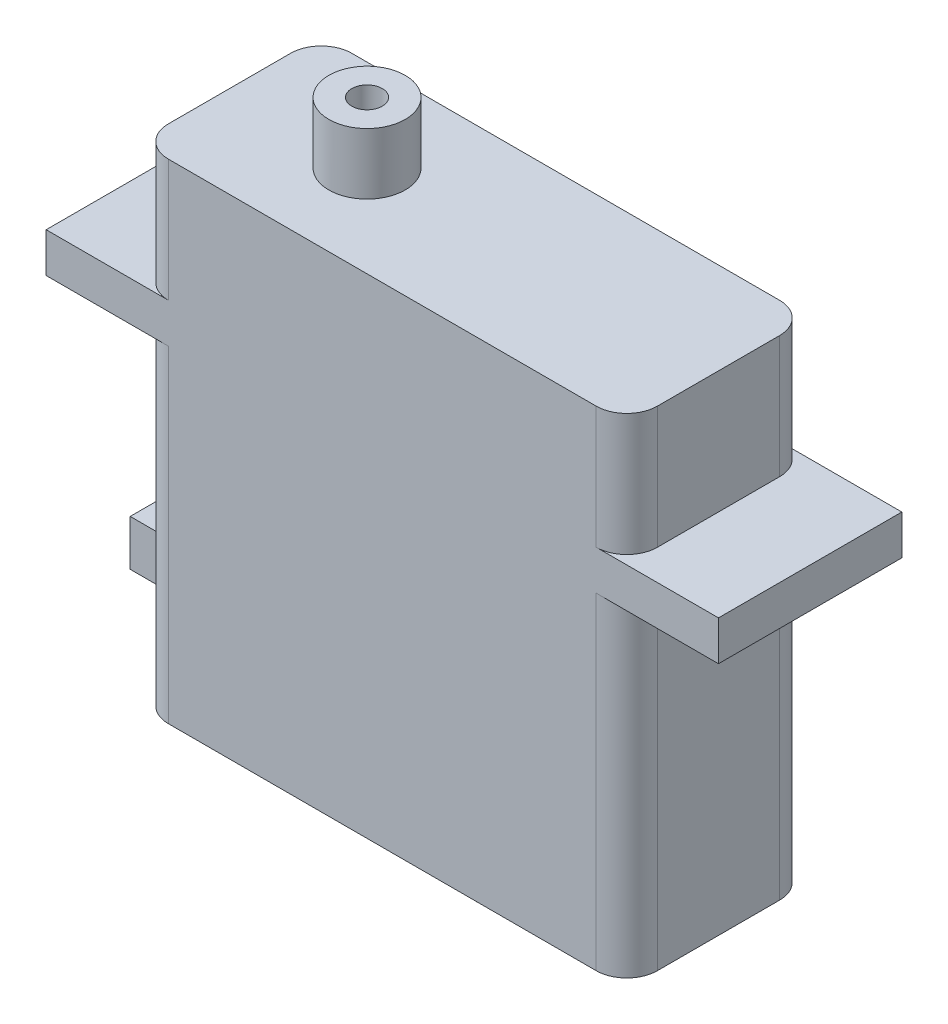
ISO-10303-21;
HEADER;
FILE_DESCRIPTION(('STEP AP214'),'2;1');
FILE_NAME('part.step','',(''),(''),'','','');
FILE_SCHEMA(('AUTOMOTIVE_DESIGN { 1 0 10303 214 1 1 1 1 }'));
ENDSEC;
DATA;
#1=APPLICATION_CONTEXT('core data for automotive mechanical design processes');
#2=APPLICATION_PROTOCOL_DEFINITION('international standard','automotive_design',2000,#1);
#3=PRODUCT_CONTEXT('',#1,'mechanical');
#4=PRODUCT('Part','Part','',(#3));
#5=PRODUCT_RELATED_PRODUCT_CATEGORY('part','',(#4));
#6=PRODUCT_DEFINITION_FORMATION('','',#4);
#7=PRODUCT_DEFINITION_CONTEXT('part definition',#1,'design');
#8=PRODUCT_DEFINITION('design','',#6,#7);
#9=PRODUCT_DEFINITION_SHAPE('','',#8);
#10=(LENGTH_UNIT() NAMED_UNIT(*) SI_UNIT(.MILLI.,.METRE.));
#11=(NAMED_UNIT(*) PLANE_ANGLE_UNIT() SI_UNIT($,.RADIAN.));
#12=(NAMED_UNIT(*) SI_UNIT($,.STERADIAN.) SOLID_ANGLE_UNIT());
#13=UNCERTAINTY_MEASURE_WITH_UNIT(LENGTH_MEASURE(1.E-05),#10,'distance_accuracy_value','');
#14=(GEOMETRIC_REPRESENTATION_CONTEXT(3) GLOBAL_UNCERTAINTY_ASSIGNED_CONTEXT((#13)) GLOBAL_UNIT_ASSIGNED_CONTEXT((#10,
#11,#12)) REPRESENTATION_CONTEXT('',''));
#15=CARTESIAN_POINT('',(0.,0.,0.));
#16=DIRECTION('',(0.,0.,1.));
#17=DIRECTION('',(1.,0.,0.));
#18=AXIS2_PLACEMENT_3D('',#15,#16,#17);
#19=CARTESIAN_POINT('',(41.5914381270903,0.,15.24));
#20=DIRECTION('',(-1.,0.,0.));
#21=DIRECTION('',(0.,0.,1.));
#22=AXIS2_PLACEMENT_3D('',#19,#20,#21);
#23=PLANE('',#22);
#24=DIRECTION('',(0.,1.,0.));
#25=VECTOR('',#24,1.);
#26=CARTESIAN_POINT('',(41.5914381270903,0.,12.7));
#27=LINE('',#26,#25);
#28=CARTESIAN_POINT('',(41.5914381270903,40.64,12.7));
#29=VERTEX_POINT('',#28);
#30=CARTESIAN_POINT('',(41.5914381270903,30.48,12.7));
#31=VERTEX_POINT('',#30);
#32=EDGE_CURVE('E369',#29,#31,#27,.F.);
#33=ORIENTED_EDGE('',*,*,#32,.T.);
#34=DIRECTION('',(0.,0.,-1.));
#35=VECTOR('',#34,1.);
#36=CARTESIAN_POINT('',(41.5914381270903,30.48,15.24));
#37=LINE('',#36,#35);
#38=CARTESIAN_POINT('',(41.5914381270903,30.48,2.54));
#39=VERTEX_POINT('',#38);
#40=EDGE_CURVE('E229',#31,#39,#37,.T.);
#41=ORIENTED_EDGE('',*,*,#40,.T.);
#42=DIRECTION('',(0.,1.,0.));
#43=VECTOR('',#42,1.);
#44=CARTESIAN_POINT('',(41.5914381270903,40.64,2.54));
#45=LINE('',#44,#43);
#46=CARTESIAN_POINT('',(41.5914381270903,40.64,2.54));
#47=VERTEX_POINT('',#46);
#48=EDGE_CURVE('E372',#39,#47,#45,.T.);
#49=ORIENTED_EDGE('',*,*,#48,.T.);
#50=DIRECTION('',(0.,0.,-1.));
#51=VECTOR('',#50,1.);
#52=CARTESIAN_POINT('',(41.5914381270903,40.64,15.24));
#53=LINE('',#52,#51);
#54=EDGE_CURVE('E318',#29,#47,#53,.T.);
#55=ORIENTED_EDGE('',*,*,#54,.F.);
#56=EDGE_LOOP('',(#33,#41,#49,#55));
#57=FACE_BOUND('',#56,.T.);
#58=ADVANCED_FACE('F33',(#57),#23,.F.);
#59=CARTESIAN_POINT('',(39.0514381270903,0.,2.54));
#60=DIRECTION('',(0.,-1.,0.));
#61=DIRECTION('',(0.,0.,-1.));
#62=AXIS2_PLACEMENT_3D('',#59,#60,#61);
#63=CYLINDRICAL_SURFACE('',#62,2.54);
#64=CARTESIAN_POINT('',(39.0514381270903,30.48,2.54));
#65=DIRECTION('',(0.,1.,0.));
#66=DIRECTION('',(0.,0.,1.));
#67=AXIS2_PLACEMENT_3D('',#64,#65,#66);
#68=CIRCLE('',#67,2.54);
#69=CARTESIAN_POINT('',(39.0514381270903,30.48,0.));
#70=VERTEX_POINT('',#69);
#71=EDGE_CURVE('E232',#70,#39,#68,.F.);
#72=ORIENTED_EDGE('',*,*,#71,.F.);
#73=DIRECTION('',(0.,1.,0.));
#74=VECTOR('',#73,1.);
#75=CARTESIAN_POINT('',(39.0514381270903,0.,0.));
#76=LINE('',#75,#74);
#77=CARTESIAN_POINT('',(39.0514381270903,40.64,0.));
#78=VERTEX_POINT('',#77);
#79=EDGE_CURVE('E347',#78,#70,#76,.F.);
#80=ORIENTED_EDGE('',*,*,#79,.F.);
#81=CARTESIAN_POINT('',(39.0514381270903,40.64,2.54));
#82=DIRECTION('',(0.,-1.,0.));
#83=DIRECTION('',(0.,0.,-1.));
#84=AXIS2_PLACEMENT_3D('',#81,#82,#83);
#85=CIRCLE('',#84,2.54);
#86=EDGE_CURVE('E356',#47,#78,#85,.F.);
#87=ORIENTED_EDGE('',*,*,#86,.F.);
#88=ORIENTED_EDGE('',*,*,#48,.F.);
#89=EDGE_LOOP('',(#72,#80,#87,#88));
#90=FACE_BOUND('',#89,.T.);
#91=ADVANCED_FACE('F414',(#90),#63,.T.);
#92=CARTESIAN_POINT('',(39.0514381270903,0.,12.7));
#93=DIRECTION('',(0.,1.,0.));
#94=DIRECTION('',(0.,0.,1.));
#95=AXIS2_PLACEMENT_3D('',#92,#93,#94);
#96=CYLINDRICAL_SURFACE('',#95,2.54);
#97=CARTESIAN_POINT('',(39.0514381270903,30.48,12.7));
#98=DIRECTION('',(0.,1.,0.));
#99=DIRECTION('',(0.,0.,1.));
#100=AXIS2_PLACEMENT_3D('',#97,#98,#99);
#101=CIRCLE('',#100,2.54);
#102=CARTESIAN_POINT('',(39.0514381270903,30.48,15.24));
#103=VERTEX_POINT('',#102);
#104=EDGE_CURVE('E11',#31,#103,#101,.F.);
#105=ORIENTED_EDGE('',*,*,#104,.F.);
#106=ORIENTED_EDGE('',*,*,#32,.F.);
#107=CARTESIAN_POINT('',(39.0514381270903,40.64,12.7));
#108=DIRECTION('',(0.,-1.,0.));
#109=DIRECTION('',(0.,0.,-1.));
#110=AXIS2_PLACEMENT_3D('',#107,#108,#109);
#111=CIRCLE('',#110,2.54);
#112=CARTESIAN_POINT('',(39.0514381270903,40.64,15.24));
#113=VERTEX_POINT('',#112);
#114=EDGE_CURVE('E354',#113,#29,#111,.F.);
#115=ORIENTED_EDGE('',*,*,#114,.F.);
#116=DIRECTION('',(0.,1.,0.));
#117=VECTOR('',#116,1.);
#118=CARTESIAN_POINT('',(39.0514381270903,0.,15.24));
#119=LINE('',#118,#117);
#120=EDGE_CURVE('E362',#103,#113,#119,.T.);
#121=ORIENTED_EDGE('',*,*,#120,.F.);
#122=EDGE_LOOP('',(#105,#106,#115,#121));
#123=FACE_BOUND('',#122,.T.);
#124=ADVANCED_FACE('F420',(#123),#96,.T.);
#125=CARTESIAN_POINT('',(0.951438127090312,0.,15.24));
#126=DIRECTION('',(1.,0.,0.));
#127=DIRECTION('',(0.,1.,0.));
#128=AXIS2_PLACEMENT_3D('',#125,#126,#127);
#129=PLANE('',#128);
#130=DIRECTION('',(0.,-1.,0.));
#131=VECTOR('',#130,1.);
#132=CARTESIAN_POINT('',(0.951438127090313,0.,2.54));
#133=LINE('',#132,#131);
#134=CARTESIAN_POINT('',(0.951438127090309,40.64,2.54));
#135=VERTEX_POINT('',#134);
#136=CARTESIAN_POINT('',(0.95143812709031,30.48,2.54));
#137=VERTEX_POINT('',#136);
#138=EDGE_CURVE('E335',#135,#137,#133,.T.);
#139=ORIENTED_EDGE('',*,*,#138,.T.);
#140=DIRECTION('',(0.,0.,1.));
#141=VECTOR('',#140,1.);
#142=CARTESIAN_POINT('',(0.95143812709031,30.48,15.24));
#143=LINE('',#142,#141);
#144=CARTESIAN_POINT('',(0.95143812709031,30.48,12.7));
#145=VERTEX_POINT('',#144);
#146=EDGE_CURVE('E258',#137,#145,#143,.T.);
#147=ORIENTED_EDGE('',*,*,#146,.T.);
#148=DIRECTION('',(0.,-1.,0.));
#149=VECTOR('',#148,1.);
#150=CARTESIAN_POINT('',(0.951438127090312,0.,12.7));
#151=LINE('',#150,#149);
#152=CARTESIAN_POINT('',(0.951438127090309,40.64,12.7));
#153=VERTEX_POINT('',#152);
#154=EDGE_CURVE('E330',#145,#153,#151,.F.);
#155=ORIENTED_EDGE('',*,*,#154,.T.);
#156=DIRECTION('',(0.,0.,-1.));
#157=VECTOR('',#156,1.);
#158=CARTESIAN_POINT('',(0.951438127090309,40.64,15.24));
#159=LINE('',#158,#157);
#160=EDGE_CURVE('E311',#153,#135,#159,.T.);
#161=ORIENTED_EDGE('',*,*,#160,.T.);
#162=EDGE_LOOP('',(#139,#147,#155,#161));
#163=FACE_BOUND('',#162,.T.);
#164=ADVANCED_FACE('F443',(#163),#129,.F.);
#165=CARTESIAN_POINT('',(3.49143812709031,0.,2.54));
#166=DIRECTION('',(0.,1.,0.));
#167=DIRECTION('',(-1.,0.,0.));
#168=AXIS2_PLACEMENT_3D('',#165,#166,#167);
#169=CYLINDRICAL_SURFACE('',#168,2.54);
#170=CARTESIAN_POINT('',(3.49143812709031,30.48,2.54));
#171=DIRECTION('',(0.,1.,0.));
#172=DIRECTION('',(-1.,0.,0.));
#173=AXIS2_PLACEMENT_3D('',#170,#171,#172);
#174=CIRCLE('',#173,2.54);
#175=CARTESIAN_POINT('',(3.49143812709031,30.48,0.));
#176=VERTEX_POINT('',#175);
#177=EDGE_CURVE('E261',#137,#176,#174,.F.);
#178=ORIENTED_EDGE('',*,*,#177,.F.);
#179=ORIENTED_EDGE('',*,*,#138,.F.);
#180=CARTESIAN_POINT('',(3.49143812709031,40.64,2.54));
#181=DIRECTION('',(0.,-1.,0.));
#182=DIRECTION('',(0.,0.,-1.));
#183=AXIS2_PLACEMENT_3D('',#180,#181,#182);
#184=CIRCLE('',#183,2.54);
#185=CARTESIAN_POINT('',(3.49143812709031,40.64,0.));
#186=VERTEX_POINT('',#185);
#187=EDGE_CURVE('E360',#186,#135,#184,.F.);
#188=ORIENTED_EDGE('',*,*,#187,.F.);
#189=DIRECTION('',(0.,-1.,0.));
#190=VECTOR('',#189,1.);
#191=CARTESIAN_POINT('',(3.49143812709031,40.64,0.));
#192=LINE('',#191,#190);
#193=EDGE_CURVE('E350',#176,#186,#192,.F.);
#194=ORIENTED_EDGE('',*,*,#193,.F.);
#195=EDGE_LOOP('',(#178,#179,#188,#194));
#196=FACE_BOUND('',#195,.T.);
#197=ADVANCED_FACE('F447',(#196),#169,.T.);
#198=CARTESIAN_POINT('',(3.49143812709031,0.,12.7));
#199=DIRECTION('',(0.,-1.,0.));
#200=DIRECTION('',(1.,0.,0.));
#201=AXIS2_PLACEMENT_3D('',#198,#199,#200);
#202=CYLINDRICAL_SURFACE('',#201,2.54);
#203=CARTESIAN_POINT('',(3.49143812709031,30.48,12.7));
#204=DIRECTION('',(0.,1.,0.));
#205=DIRECTION('',(-1.,0.,0.));
#206=AXIS2_PLACEMENT_3D('',#203,#204,#205);
#207=CIRCLE('',#206,2.54);
#208=CARTESIAN_POINT('',(3.49143812709031,30.48,15.24));
#209=VERTEX_POINT('',#208);
#210=EDGE_CURVE('E378',#209,#145,#207,.F.);
#211=ORIENTED_EDGE('',*,*,#210,.F.);
#212=DIRECTION('',(0.,-1.,0.));
#213=VECTOR('',#212,1.);
#214=CARTESIAN_POINT('',(3.49143812709031,0.,15.24));
#215=LINE('',#214,#213);
#216=CARTESIAN_POINT('',(3.49143812709031,40.64,15.24));
#217=VERTEX_POINT('',#216);
#218=EDGE_CURVE('E365',#217,#209,#215,.T.);
#219=ORIENTED_EDGE('',*,*,#218,.F.);
#220=CARTESIAN_POINT('',(3.49143812709031,40.64,12.7));
#221=DIRECTION('',(0.,-1.,0.));
#222=DIRECTION('',(0.,0.,-1.));
#223=AXIS2_PLACEMENT_3D('',#220,#221,#222);
#224=CIRCLE('',#223,2.54);
#225=EDGE_CURVE('E358',#153,#217,#224,.F.);
#226=ORIENTED_EDGE('',*,*,#225,.F.);
#227=ORIENTED_EDGE('',*,*,#154,.F.);
#228=EDGE_LOOP('',(#211,#219,#226,#227));
#229=FACE_BOUND('',#228,.T.);
#230=ADVANCED_FACE('F422',(#229),#202,.T.);
#231=CARTESIAN_POINT('',(0.951438127090312,0.,12.7));
#232=VERTEX_POINT('',#231);
#233=CARTESIAN_POINT('',(0.951438127090309,27.178,12.7));
#234=VERTEX_POINT('',#233);
#235=EDGE_CURVE('E331',#232,#234,#151,.F.);
#236=ORIENTED_EDGE('',*,*,#235,.T.);
#237=DIRECTION('',(0.,0.,-1.));
#238=VECTOR('',#237,1.);
#239=CARTESIAN_POINT('',(0.95143812709031,27.178,15.24));
#240=LINE('',#239,#238);
#241=CARTESIAN_POINT('',(0.95143812709031,27.178,2.54));
#242=VERTEX_POINT('',#241);
#243=EDGE_CURVE('E249',#234,#242,#240,.T.);
#244=ORIENTED_EDGE('',*,*,#243,.T.);
#245=CARTESIAN_POINT('',(0.951438127090312,0.,2.54));
#246=VERTEX_POINT('',#245);
#247=EDGE_CURVE('E334',#242,#246,#133,.T.);
#248=ORIENTED_EDGE('',*,*,#247,.T.);
#249=DIRECTION('',(0.,0.,-1.));
#250=VECTOR('',#249,1.);
#251=CARTESIAN_POINT('',(0.951438127090312,0.,15.24));
#252=LINE('',#251,#250);
#253=EDGE_CURVE('E324',#232,#246,#252,.T.);
#254=ORIENTED_EDGE('',*,*,#253,.F.);
#255=EDGE_LOOP('',(#236,#244,#248,#254));
#256=FACE_BOUND('',#255,.T.);
#257=DIRECTION('',(0.,-1.,0.));
#258=VECTOR('',#257,1.);
#259=CARTESIAN_POINT('',(0.951438127090312,5.08,4.445));
#260=LINE('',#259,#258);
#261=CARTESIAN_POINT('',(0.951438127090311,8.89,4.445));
#262=VERTEX_POINT('',#261);
#263=CARTESIAN_POINT('',(0.951438127090312,5.08,4.445));
#264=VERTEX_POINT('',#263);
#265=EDGE_CURVE('E263',#262,#264,#260,.T.);
#266=ORIENTED_EDGE('',*,*,#265,.F.);
#267=DIRECTION('',(0.,0.,-1.));
#268=VECTOR('',#267,1.);
#269=CARTESIAN_POINT('',(0.951438127090311,8.89,4.445));
#270=LINE('',#269,#268);
#271=CARTESIAN_POINT('',(0.951438127090311,8.89,10.795));
#272=VERTEX_POINT('',#271);
#273=EDGE_CURVE('E268',#272,#262,#270,.T.);
#274=ORIENTED_EDGE('',*,*,#273,.F.);
#275=DIRECTION('',(0.,1.,0.));
#276=VECTOR('',#275,1.);
#277=CARTESIAN_POINT('',(0.951438127090312,5.08,10.795));
#278=LINE('',#277,#276);
#279=CARTESIAN_POINT('',(0.951438127090312,5.08,10.795));
#280=VERTEX_POINT('',#279);
#281=EDGE_CURVE('E280',#280,#272,#278,.T.);
#282=ORIENTED_EDGE('',*,*,#281,.F.);
#283=DIRECTION('',(0.,0.,1.));
#284=VECTOR('',#283,1.);
#285=CARTESIAN_POINT('',(0.951438127090312,5.08,4.445));
#286=LINE('',#285,#284);
#287=EDGE_CURVE('E277',#264,#280,#286,.T.);
#288=ORIENTED_EDGE('',*,*,#287,.F.);
#289=EDGE_LOOP('',(#266,#274,#282,#288));
#290=FACE_BOUND('',#289,.T.);
#291=ADVANCED_FACE('F398',(#256,#290),#129,.F.);
#292=CARTESIAN_POINT('',(0.951438127090312,0.,15.24));
#293=DIRECTION('',(0.,1.,0.));
#294=DIRECTION('',(0.,0.,1.));
#295=AXIS2_PLACEMENT_3D('',#292,#293,#294);
#296=PLANE('',#295);
#297=ORIENTED_EDGE('',*,*,#253,.T.);
#298=CARTESIAN_POINT('',(3.49143812709031,0.,2.54));
#299=DIRECTION('',(0.,1.,0.));
#300=DIRECTION('',(0.,0.,1.));
#301=AXIS2_PLACEMENT_3D('',#298,#299,#300);
#302=CIRCLE('',#301,2.54);
#303=CARTESIAN_POINT('',(3.49143812709031,0.,0.));
#304=VERTEX_POINT('',#303);
#305=EDGE_CURVE('E344',#246,#304,#302,.F.);
#306=ORIENTED_EDGE('',*,*,#305,.T.);
#307=DIRECTION('',(1.,0.,0.));
#308=VECTOR('',#307,1.);
#309=CARTESIAN_POINT('',(0.951438127090312,0.,0.));
#310=LINE('',#309,#308);
#311=CARTESIAN_POINT('',(39.0514381270903,0.,0.));
#312=VERTEX_POINT('',#311);
#313=EDGE_CURVE('E305',#304,#312,#310,.T.);
#314=ORIENTED_EDGE('',*,*,#313,.T.);
#315=CARTESIAN_POINT('',(39.0514381270903,0.,2.54));
#316=DIRECTION('',(0.,1.,0.));
#317=DIRECTION('',(0.,0.,1.));
#318=AXIS2_PLACEMENT_3D('',#315,#316,#317);
#319=CIRCLE('',#318,2.54);
#320=CARTESIAN_POINT('',(41.5914381270903,0.,2.54));
#321=VERTEX_POINT('',#320);
#322=EDGE_CURVE('E340',#312,#321,#319,.F.);
#323=ORIENTED_EDGE('',*,*,#322,.T.);
#324=DIRECTION('',(0.,0.,-1.));
#325=VECTOR('',#324,1.);
#326=CARTESIAN_POINT('',(41.5914381270903,0.,15.24));
#327=LINE('',#326,#325);
#328=CARTESIAN_POINT('',(41.5914381270903,0.,12.7));
#329=VERTEX_POINT('',#328);
#330=EDGE_CURVE('E321',#329,#321,#327,.T.);
#331=ORIENTED_EDGE('',*,*,#330,.F.);
#332=CARTESIAN_POINT('',(39.0514381270903,0.,12.7));
#333=DIRECTION('',(0.,1.,0.));
#334=DIRECTION('',(0.,0.,1.));
#335=AXIS2_PLACEMENT_3D('',#332,#333,#334);
#336=CIRCLE('',#335,2.54);
#337=CARTESIAN_POINT('',(39.0514381270903,0.,15.24));
#338=VERTEX_POINT('',#337);
#339=EDGE_CURVE('E338',#329,#338,#336,.F.);
#340=ORIENTED_EDGE('',*,*,#339,.T.);
#341=DIRECTION('',(1.,0.,0.));
#342=VECTOR('',#341,1.);
#343=CARTESIAN_POINT('',(0.951438127090312,0.,15.24));
#344=LINE('',#343,#342);
#345=CARTESIAN_POINT('',(3.49143812709031,0.,15.24));
#346=VERTEX_POINT('',#345);
#347=EDGE_CURVE('E306',#346,#338,#344,.T.);
#348=ORIENTED_EDGE('',*,*,#347,.F.);
#349=CARTESIAN_POINT('',(3.49143812709031,0.,12.7));
#350=DIRECTION('',(0.,1.,0.));
#351=DIRECTION('',(0.,0.,1.));
#352=AXIS2_PLACEMENT_3D('',#349,#350,#351);
#353=CIRCLE('',#352,2.54);
#354=EDGE_CURVE('E342',#346,#232,#353,.F.);
#355=ORIENTED_EDGE('',*,*,#354,.T.);
#356=EDGE_LOOP('',(#297,#306,#314,#323,#331,#340,#348,#355));
#357=FACE_BOUND('',#356,.T.);
#358=ADVANCED_FACE('F389',(#357),#296,.F.);
#359=CARTESIAN_POINT('',(41.5914381270903,27.178,2.54));
#360=VERTEX_POINT('',#359);
#361=EDGE_CURVE('E373',#321,#360,#45,.T.);
#362=ORIENTED_EDGE('',*,*,#361,.T.);
#363=DIRECTION('',(0.,0.,1.));
#364=VECTOR('',#363,1.);
#365=CARTESIAN_POINT('',(41.5914381270903,27.178,15.24));
#366=LINE('',#365,#364);
#367=CARTESIAN_POINT('',(41.5914381270903,27.178,12.7));
#368=VERTEX_POINT('',#367);
#369=EDGE_CURVE('E221',#360,#368,#366,.T.);
#370=ORIENTED_EDGE('',*,*,#369,.T.);
#371=EDGE_CURVE('E368',#368,#329,#27,.F.);
#372=ORIENTED_EDGE('',*,*,#371,.T.);
#373=ORIENTED_EDGE('',*,*,#330,.T.);
#374=EDGE_LOOP('',(#362,#370,#372,#373));
#375=FACE_BOUND('',#374,.T.);
#376=ADVANCED_FACE('F383',(#375),#23,.F.);
#377=CARTESIAN_POINT('',(0.951438127090309,40.64,15.24));
#378=DIRECTION('',(0.,-1.,0.));
#379=DIRECTION('',(0.,0.,-1.));
#380=AXIS2_PLACEMENT_3D('',#377,#378,#379);
#381=PLANE('',#380);
#382=CARTESIAN_POINT('',(12.3814381270903,40.64,7.62));
#383=DIRECTION('',(0.,-1.,0.));
#384=DIRECTION('',(0.,0.,-1.));
#385=AXIS2_PLACEMENT_3D('',#382,#383,#384);
#386=CIRCLE('',#385,3.175);
#387=CARTESIAN_POINT('',(12.3814381270903,40.64,4.445));
#388=VERTEX_POINT('',#387);
#389=EDGE_CURVE('E327',#388,#388,#386,.F.);
#390=ORIENTED_EDGE('',*,*,#389,.F.);
#391=EDGE_LOOP('',(#390));
#392=FACE_BOUND('',#391,.T.);
#393=DIRECTION('',(-1.,0.,0.));
#394=VECTOR('',#393,1.);
#395=CARTESIAN_POINT('',(0.951438127090309,40.64,0.));
#396=LINE('',#395,#394);
#397=EDGE_CURVE('E309',#78,#186,#396,.T.);
#398=ORIENTED_EDGE('',*,*,#397,.T.);
#399=ORIENTED_EDGE('',*,*,#187,.T.);
#400=ORIENTED_EDGE('',*,*,#160,.F.);
#401=ORIENTED_EDGE('',*,*,#225,.T.);
#402=DIRECTION('',(-1.,0.,0.));
#403=VECTOR('',#402,1.);
#404=CARTESIAN_POINT('',(0.951438127090309,40.64,15.24));
#405=LINE('',#404,#403);
#406=EDGE_CURVE('E308',#113,#217,#405,.T.);
#407=ORIENTED_EDGE('',*,*,#406,.F.);
#408=ORIENTED_EDGE('',*,*,#114,.T.);
#409=ORIENTED_EDGE('',*,*,#54,.T.);
#410=ORIENTED_EDGE('',*,*,#86,.T.);
#411=EDGE_LOOP('',(#398,#399,#400,#401,#407,#408,#409,#410));
#412=FACE_BOUND('',#411,.T.);
#413=ADVANCED_FACE('F433',(#392,#412),#381,.F.);
#414=CARTESIAN_POINT('',(0.,0.,15.24));
#415=DIRECTION('',(0.,0.,-1.));
#416=DIRECTION('',(-1.,0.,0.));
#417=AXIS2_PLACEMENT_3D('',#414,#415,#416);
#418=PLANE('',#417);
#419=ORIENTED_EDGE('',*,*,#406,.T.);
#420=ORIENTED_EDGE('',*,*,#218,.T.);
#421=DIRECTION('',(-1.,0.,0.));
#422=VECTOR('',#421,1.);
#423=CARTESIAN_POINT('',(3.49143812709031,30.48,15.24));
#424=LINE('',#423,#422);
#425=CARTESIAN_POINT('',(-6.66856187290969,30.48,15.24));
#426=VERTEX_POINT('',#425);
#427=EDGE_CURVE('E250',#209,#426,#424,.T.);
#428=ORIENTED_EDGE('',*,*,#427,.T.);
#429=DIRECTION('',(0.,1.,0.));
#430=VECTOR('',#429,1.);
#431=CARTESIAN_POINT('',(-6.66856187290969,30.48,15.24));
#432=LINE('',#431,#430);
#433=CARTESIAN_POINT('',(-6.66856187290969,27.178,15.24));
#434=VERTEX_POINT('',#433);
#435=EDGE_CURVE('E240',#434,#426,#432,.T.);
#436=ORIENTED_EDGE('',*,*,#435,.F.);
#437=DIRECTION('',(-1.,0.,0.));
#438=VECTOR('',#437,1.);
#439=CARTESIAN_POINT('',(3.49143812709031,27.178,15.24));
#440=LINE('',#439,#438);
#441=CARTESIAN_POINT('',(3.49143812709031,27.178,15.24));
#442=VERTEX_POINT('',#441);
#443=EDGE_CURVE('E54',#442,#434,#440,.T.);
#444=ORIENTED_EDGE('',*,*,#443,.F.);
#445=EDGE_CURVE('E364',#442,#346,#215,.T.);
#446=ORIENTED_EDGE('',*,*,#445,.T.);
#447=ORIENTED_EDGE('',*,*,#347,.T.);
#448=CARTESIAN_POINT('',(39.0514381270903,27.178,15.24));
#449=VERTEX_POINT('',#448);
#450=EDGE_CURVE('E198',#338,#449,#119,.T.);
#451=ORIENTED_EDGE('',*,*,#450,.T.);
#452=DIRECTION('',(1.,0.,0.));
#453=VECTOR('',#452,1.);
#454=CARTESIAN_POINT('',(39.0514381270903,27.178,15.24));
#455=LINE('',#454,#453);
#456=CARTESIAN_POINT('',(49.2114381270903,27.178,15.24));
#457=VERTEX_POINT('',#456);
#458=EDGE_CURVE('E190',#449,#457,#455,.T.);
#459=ORIENTED_EDGE('',*,*,#458,.T.);
#460=DIRECTION('',(0.,-1.,0.));
#461=VECTOR('',#460,1.);
#462=CARTESIAN_POINT('',(49.2114381270903,30.48,15.24));
#463=LINE('',#462,#461);
#464=CARTESIAN_POINT('',(49.2114381270903,30.48,15.24));
#465=VERTEX_POINT('',#464);
#466=EDGE_CURVE('E195',#465,#457,#463,.T.);
#467=ORIENTED_EDGE('',*,*,#466,.F.);
#468=DIRECTION('',(1.,0.,0.));
#469=VECTOR('',#468,1.);
#470=CARTESIAN_POINT('',(39.0514381270903,30.48,15.24));
#471=LINE('',#470,#469);
#472=EDGE_CURVE('E48',#103,#465,#471,.T.);
#473=ORIENTED_EDGE('',*,*,#472,.F.);
#474=ORIENTED_EDGE('',*,*,#120,.T.);
#475=EDGE_LOOP('',(#419,#420,#428,#436,#444,#446,#447,#451,#459,#467,#473,#474));
#476=FACE_BOUND('',#475,.T.);
#477=ADVANCED_FACE('F193',(#476),#418,.F.);
#478=CARTESIAN_POINT('',(0.,0.,0.));
#479=DIRECTION('',(0.,0.,-1.));
#480=DIRECTION('',(-1.,0.,0.));
#481=AXIS2_PLACEMENT_3D('',#478,#479,#480);
#482=PLANE('',#481);
#483=ORIENTED_EDGE('',*,*,#313,.F.);
#484=CARTESIAN_POINT('',(3.49143812709031,27.178,0.));
#485=VERTEX_POINT('',#484);
#486=EDGE_CURVE('E351',#304,#485,#192,.F.);
#487=ORIENTED_EDGE('',*,*,#486,.T.);
#488=DIRECTION('',(-1.,0.,0.));
#489=VECTOR('',#488,1.);
#490=CARTESIAN_POINT('',(3.49143812709031,27.178,0.));
#491=LINE('',#490,#489);
#492=CARTESIAN_POINT('',(-6.66856187290969,27.178,0.));
#493=VERTEX_POINT('',#492);
#494=EDGE_CURVE('E246',#485,#493,#491,.T.);
#495=ORIENTED_EDGE('',*,*,#494,.T.);
#496=DIRECTION('',(0.,-1.,0.));
#497=VECTOR('',#496,1.);
#498=CARTESIAN_POINT('',(-6.66856187290969,30.48,0.));
#499=LINE('',#498,#497);
#500=CARTESIAN_POINT('',(-6.66856187290969,30.48,0.));
#501=VERTEX_POINT('',#500);
#502=EDGE_CURVE('E234',#501,#493,#499,.T.);
#503=ORIENTED_EDGE('',*,*,#502,.F.);
#504=DIRECTION('',(-1.,0.,0.));
#505=VECTOR('',#504,1.);
#506=CARTESIAN_POINT('',(3.49143812709031,30.48,0.));
#507=LINE('',#506,#505);
#508=EDGE_CURVE('E247',#176,#501,#507,.T.);
#509=ORIENTED_EDGE('',*,*,#508,.F.);
#510=ORIENTED_EDGE('',*,*,#193,.T.);
#511=ORIENTED_EDGE('',*,*,#397,.F.);
#512=ORIENTED_EDGE('',*,*,#79,.T.);
#513=DIRECTION('',(1.,0.,0.));
#514=VECTOR('',#513,1.);
#515=CARTESIAN_POINT('',(39.0514381270903,30.48,0.));
#516=LINE('',#515,#514);
#517=CARTESIAN_POINT('',(49.2114381270903,30.48,0.));
#518=VERTEX_POINT('',#517);
#519=EDGE_CURVE('E222',#70,#518,#516,.T.);
#520=ORIENTED_EDGE('',*,*,#519,.T.);
#521=DIRECTION('',(0.,1.,0.));
#522=VECTOR('',#521,1.);
#523=CARTESIAN_POINT('',(49.2114381270903,30.48,0.));
#524=LINE('',#523,#522);
#525=CARTESIAN_POINT('',(49.2114381270903,27.178,0.));
#526=VERTEX_POINT('',#525);
#527=EDGE_CURVE('E211',#526,#518,#524,.T.);
#528=ORIENTED_EDGE('',*,*,#527,.F.);
#529=DIRECTION('',(1.,0.,0.));
#530=VECTOR('',#529,1.);
#531=CARTESIAN_POINT('',(39.0514381270903,27.178,0.));
#532=LINE('',#531,#530);
#533=CARTESIAN_POINT('',(39.0514381270903,27.178,0.));
#534=VERTEX_POINT('',#533);
#535=EDGE_CURVE('E201',#534,#526,#532,.T.);
#536=ORIENTED_EDGE('',*,*,#535,.F.);
#537=EDGE_CURVE('E346',#534,#312,#76,.F.);
#538=ORIENTED_EDGE('',*,*,#537,.T.);
#539=EDGE_LOOP('',(#483,#487,#495,#503,#509,#510,#511,#512,#520,#528,#536,#538));
#540=FACE_BOUND('',#539,.T.);
#541=ADVANCED_FACE('F409',(#540),#482,.T.);
#542=CARTESIAN_POINT('',(12.3814381270903,45.72,7.62));
#543=DIRECTION('',(0.,-1.,0.));
#544=DIRECTION('',(0.,0.,-1.));
#545=AXIS2_PLACEMENT_3D('',#542,#543,#544);
#546=CYLINDRICAL_SURFACE('',#545,3.175);
#547=CARTESIAN_POINT('',(12.3814381270903,45.72,7.62));
#548=DIRECTION('',(0.,1.,0.));
#549=DIRECTION('',(0.,0.,1.));
#550=AXIS2_PLACEMENT_3D('',#547,#548,#549);
#551=CIRCLE('',#550,3.175);
#552=CARTESIAN_POINT('',(12.3814381270903,45.72,10.795));
#553=VERTEX_POINT('',#552);
#554=EDGE_CURVE('E300',#553,#553,#551,.T.);
#555=ORIENTED_EDGE('',*,*,#554,.F.);
#556=EDGE_LOOP('',(#555));
#557=FACE_BOUND('',#556,.T.);
#558=ORIENTED_EDGE('',*,*,#389,.T.);
#559=EDGE_LOOP('',(#558));
#560=FACE_BOUND('',#559,.T.);
#561=ADVANCED_FACE('F530',(#557,#560),#546,.T.);
#562=CARTESIAN_POINT('',(12.3814381270903,45.72,7.62));
#563=DIRECTION('',(0.,1.,0.));
#564=DIRECTION('',(0.,0.,1.));
#565=AXIS2_PLACEMENT_3D('',#562,#563,#564);
#566=PLANE('',#565);
#567=CARTESIAN_POINT('',(12.3814381270903,45.72,7.62));
#568=DIRECTION('',(0.,1.,0.));
#569=DIRECTION('',(0.,0.,1.));
#570=AXIS2_PLACEMENT_3D('',#567,#568,#569);
#571=CIRCLE('',#570,1.27);
#572=CARTESIAN_POINT('',(12.3814381270903,45.72,8.89));
#573=VERTEX_POINT('',#572);
#574=EDGE_CURVE('E296',#573,#573,#571,.T.);
#575=ORIENTED_EDGE('',*,*,#574,.F.);
#576=EDGE_LOOP('',(#575));
#577=FACE_BOUND('',#576,.T.);
#578=ORIENTED_EDGE('',*,*,#554,.T.);
#579=EDGE_LOOP('',(#578));
#580=FACE_BOUND('',#579,.T.);
#581=ADVANCED_FACE('F526',(#577,#580),#566,.T.);
#582=CARTESIAN_POINT('',(12.3814381270903,40.64,7.62));
#583=DIRECTION('',(0.,1.,0.));
#584=DIRECTION('',(0.,0.,1.));
#585=AXIS2_PLACEMENT_3D('',#582,#583,#584);
#586=CYLINDRICAL_SURFACE('',#585,1.27);
#587=CARTESIAN_POINT('',(12.3814381270903,40.64,7.62));
#588=DIRECTION('',(0.,1.,0.));
#589=DIRECTION('',(0.,0.,1.));
#590=AXIS2_PLACEMENT_3D('',#587,#588,#589);
#591=CIRCLE('',#590,1.27);
#592=CARTESIAN_POINT('',(12.3814381270903,40.64,8.89));
#593=VERTEX_POINT('',#592);
#594=EDGE_CURVE('E297',#593,#593,#591,.T.);
#595=ORIENTED_EDGE('',*,*,#594,.F.);
#596=EDGE_LOOP('',(#595));
#597=FACE_BOUND('',#596,.T.);
#598=ORIENTED_EDGE('',*,*,#574,.T.);
#599=EDGE_LOOP('',(#598));
#600=FACE_BOUND('',#599,.T.);
#601=ADVANCED_FACE('F451',(#597,#600),#586,.F.);
#602=CARTESIAN_POINT('',(12.3814381270903,40.64,7.62));
#603=DIRECTION('',(0.,1.,0.));
#604=DIRECTION('',(0.,0.,1.));
#605=AXIS2_PLACEMENT_3D('',#602,#603,#604);
#606=PLANE('',#605);
#607=ORIENTED_EDGE('',*,*,#594,.T.);
#608=EDGE_LOOP('',(#607));
#609=FACE_BOUND('',#608,.T.);
#610=ADVANCED_FACE('F446',(#609),#606,.T.);
#611=CARTESIAN_POINT('',(3.49143812709031,27.178,2.54));
#612=DIRECTION('',(0.,-1.,0.));
#613=DIRECTION('',(1.,0.,0.));
#614=AXIS2_PLACEMENT_3D('',#611,#612,#613);
#615=CIRCLE('',#614,2.54);
#616=EDGE_CURVE('E256',#485,#242,#615,.F.);
#617=ORIENTED_EDGE('',*,*,#616,.F.);
#618=ORIENTED_EDGE('',*,*,#486,.F.);
#619=ORIENTED_EDGE('',*,*,#305,.F.);
#620=ORIENTED_EDGE('',*,*,#247,.F.);
#621=EDGE_LOOP('',(#617,#618,#619,#620));
#622=FACE_BOUND('',#621,.T.);
#623=ADVANCED_FACE('F405',(#622),#169,.T.);
#624=CARTESIAN_POINT('',(3.49143812709031,27.178,12.7));
#625=DIRECTION('',(0.,-1.,0.));
#626=DIRECTION('',(1.,0.,0.));
#627=AXIS2_PLACEMENT_3D('',#624,#625,#626);
#628=CIRCLE('',#627,2.54);
#629=EDGE_CURVE('E376',#234,#442,#628,.F.);
#630=ORIENTED_EDGE('',*,*,#629,.F.);
#631=ORIENTED_EDGE('',*,*,#235,.F.);
#632=ORIENTED_EDGE('',*,*,#354,.F.);
#633=ORIENTED_EDGE('',*,*,#445,.F.);
#634=EDGE_LOOP('',(#630,#631,#632,#633));
#635=FACE_BOUND('',#634,.T.);
#636=ADVANCED_FACE('F395',(#635),#202,.T.);
#637=CARTESIAN_POINT('',(39.0514381270903,27.178,2.54));
#638=DIRECTION('',(0.,-1.,0.));
#639=DIRECTION('',(0.,0.,-1.));
#640=AXIS2_PLACEMENT_3D('',#637,#638,#639);
#641=CIRCLE('',#640,2.54);
#642=EDGE_CURVE('E227',#360,#534,#641,.F.);
#643=ORIENTED_EDGE('',*,*,#642,.F.);
#644=ORIENTED_EDGE('',*,*,#361,.F.);
#645=ORIENTED_EDGE('',*,*,#322,.F.);
#646=ORIENTED_EDGE('',*,*,#537,.F.);
#647=EDGE_LOOP('',(#643,#644,#645,#646));
#648=FACE_BOUND('',#647,.T.);
#649=ADVANCED_FACE('F412',(#648),#63,.T.);
#650=CARTESIAN_POINT('',(39.0514381270903,27.178,12.7));
#651=DIRECTION('',(0.,-1.,0.));
#652=DIRECTION('',(0.,0.,-1.));
#653=AXIS2_PLACEMENT_3D('',#650,#651,#652);
#654=CIRCLE('',#653,2.54);
#655=EDGE_CURVE('E41',#449,#368,#654,.F.);
#656=ORIENTED_EDGE('',*,*,#655,.F.);
#657=ORIENTED_EDGE('',*,*,#450,.F.);
#658=ORIENTED_EDGE('',*,*,#339,.F.);
#659=ORIENTED_EDGE('',*,*,#371,.F.);
#660=EDGE_LOOP('',(#656,#657,#658,#659));
#661=FACE_BOUND('',#660,.T.);
#662=ADVANCED_FACE('F35',(#661),#96,.T.);
#663=CARTESIAN_POINT('',(-4.12856187290969,5.08,4.445));
#664=DIRECTION('',(0.,0.,1.));
#665=DIRECTION('',(1.,0.,0.));
#666=AXIS2_PLACEMENT_3D('',#663,#664,#665);
#667=PLANE('',#666);
#668=ORIENTED_EDGE('',*,*,#265,.T.);
#669=DIRECTION('',(1.,0.,0.));
#670=VECTOR('',#669,1.);
#671=CARTESIAN_POINT('',(-4.12856187290969,5.08,4.445));
#672=LINE('',#671,#670);
#673=CARTESIAN_POINT('',(-4.12856187290969,5.08,4.445));
#674=VERTEX_POINT('',#673);
#675=EDGE_CURVE('E293',#674,#264,#672,.T.);
#676=ORIENTED_EDGE('',*,*,#675,.F.);
#677=DIRECTION('',(0.,-1.,0.));
#678=VECTOR('',#677,1.);
#679=CARTESIAN_POINT('',(-4.12856187290969,5.08,4.445));
#680=LINE('',#679,#678);
#681=CARTESIAN_POINT('',(-4.12856187290969,8.89,4.445));
#682=VERTEX_POINT('',#681);
#683=EDGE_CURVE('E264',#682,#674,#680,.T.);
#684=ORIENTED_EDGE('',*,*,#683,.F.);
#685=DIRECTION('',(1.,0.,0.));
#686=VECTOR('',#685,1.);
#687=CARTESIAN_POINT('',(-4.12856187290969,8.89,4.445));
#688=LINE('',#687,#686);
#689=EDGE_CURVE('E274',#682,#262,#688,.T.);
#690=ORIENTED_EDGE('',*,*,#689,.T.);
#691=EDGE_LOOP('',(#668,#676,#684,#690));
#692=FACE_BOUND('',#691,.T.);
#693=ADVANCED_FACE('F419',(#692),#667,.F.);
#694=CARTESIAN_POINT('',(-4.12856187290969,5.08,4.445));
#695=DIRECTION('',(0.,1.,0.));
#696=DIRECTION('',(-1.,0.,0.));
#697=AXIS2_PLACEMENT_3D('',#694,#695,#696);
#698=PLANE('',#697);
#699=ORIENTED_EDGE('',*,*,#287,.T.);
#700=DIRECTION('',(1.,0.,0.));
#701=VECTOR('',#700,1.);
#702=CARTESIAN_POINT('',(-4.12856187290969,5.08,10.795));
#703=LINE('',#702,#701);
#704=CARTESIAN_POINT('',(-4.12856187290969,5.08,10.795));
#705=VERTEX_POINT('',#704);
#706=EDGE_CURVE('E290',#705,#280,#703,.T.);
#707=ORIENTED_EDGE('',*,*,#706,.F.);
#708=DIRECTION('',(0.,0.,1.));
#709=VECTOR('',#708,1.);
#710=CARTESIAN_POINT('',(-4.12856187290969,5.08,4.445));
#711=LINE('',#710,#709);
#712=EDGE_CURVE('E267',#674,#705,#711,.T.);
#713=ORIENTED_EDGE('',*,*,#712,.F.);
#714=ORIENTED_EDGE('',*,*,#675,.T.);
#715=EDGE_LOOP('',(#699,#707,#713,#714));
#716=FACE_BOUND('',#715,.T.);
#717=ADVANCED_FACE('F516',(#716),#698,.F.);
#718=CARTESIAN_POINT('',(-4.12856187290969,5.08,10.795));
#719=DIRECTION('',(0.,0.,-1.));
#720=DIRECTION('',(-1.,0.,0.));
#721=AXIS2_PLACEMENT_3D('',#718,#719,#720);
#722=PLANE('',#721);
#723=ORIENTED_EDGE('',*,*,#281,.T.);
#724=DIRECTION('',(1.,0.,0.));
#725=VECTOR('',#724,1.);
#726=CARTESIAN_POINT('',(-4.12856187290969,8.89,10.795));
#727=LINE('',#726,#725);
#728=CARTESIAN_POINT('',(-4.12856187290969,8.89,10.795));
#729=VERTEX_POINT('',#728);
#730=EDGE_CURVE('E287',#729,#272,#727,.T.);
#731=ORIENTED_EDGE('',*,*,#730,.F.);
#732=DIRECTION('',(0.,1.,0.));
#733=VECTOR('',#732,1.);
#734=CARTESIAN_POINT('',(-4.12856187290969,5.08,10.795));
#735=LINE('',#734,#733);
#736=EDGE_CURVE('E270',#705,#729,#735,.T.);
#737=ORIENTED_EDGE('',*,*,#736,.F.);
#738=ORIENTED_EDGE('',*,*,#706,.T.);
#739=EDGE_LOOP('',(#723,#731,#737,#738));
#740=FACE_BOUND('',#739,.T.);
#741=ADVANCED_FACE('F512',(#740),#722,.F.);
#742=CARTESIAN_POINT('',(-4.12856187290969,8.89,4.445));
#743=DIRECTION('',(0.,-1.,0.));
#744=DIRECTION('',(1.,0.,0.));
#745=AXIS2_PLACEMENT_3D('',#742,#743,#744);
#746=PLANE('',#745);
#747=ORIENTED_EDGE('',*,*,#273,.T.);
#748=ORIENTED_EDGE('',*,*,#689,.F.);
#749=DIRECTION('',(0.,0.,-1.));
#750=VECTOR('',#749,1.);
#751=CARTESIAN_POINT('',(-4.12856187290969,8.89,4.445));
#752=LINE('',#751,#750);
#753=EDGE_CURVE('E272',#729,#682,#752,.T.);
#754=ORIENTED_EDGE('',*,*,#753,.F.);
#755=ORIENTED_EDGE('',*,*,#730,.T.);
#756=EDGE_LOOP('',(#747,#748,#754,#755));
#757=FACE_BOUND('',#756,.T.);
#758=ADVANCED_FACE('F508',(#757),#746,.F.);
#759=CARTESIAN_POINT('',(-4.12856187290969,0.,0.));
#760=DIRECTION('',(1.,0.,0.));
#761=DIRECTION('',(0.,1.,0.));
#762=AXIS2_PLACEMENT_3D('',#759,#760,#761);
#763=PLANE('',#762);
#764=ORIENTED_EDGE('',*,*,#683,.T.);
#765=ORIENTED_EDGE('',*,*,#712,.T.);
#766=ORIENTED_EDGE('',*,*,#736,.T.);
#767=ORIENTED_EDGE('',*,*,#753,.T.);
#768=EDGE_LOOP('',(#764,#765,#766,#767));
#769=FACE_BOUND('',#768,.T.);
#770=ADVANCED_FACE('F503',(#769),#763,.F.);
#771=CARTESIAN_POINT('',(3.49143812709031,30.48,0.));
#772=DIRECTION('',(0.,1.,0.));
#773=DIRECTION('',(-1.,0.,0.));
#774=AXIS2_PLACEMENT_3D('',#771,#772,#773);
#775=PLANE('',#774);
#776=ORIENTED_EDGE('',*,*,#146,.F.);
#777=ORIENTED_EDGE('',*,*,#177,.T.);
#778=ORIENTED_EDGE('',*,*,#508,.T.);
#779=DIRECTION('',(0.,0.,-1.));
#780=VECTOR('',#779,1.);
#781=CARTESIAN_POINT('',(-6.66856187290969,30.48,0.));
#782=LINE('',#781,#780);
#783=EDGE_CURVE('E243',#426,#501,#782,.T.);
#784=ORIENTED_EDGE('',*,*,#783,.F.);
#785=ORIENTED_EDGE('',*,*,#427,.F.);
#786=ORIENTED_EDGE('',*,*,#210,.T.);
#787=EDGE_LOOP('',(#776,#777,#778,#784,#785,#786));
#788=FACE_BOUND('',#787,.T.);
#789=ADVANCED_FACE('F490',(#788),#775,.T.);
#790=CARTESIAN_POINT('',(3.49143812709031,27.178,0.));
#791=DIRECTION('',(0.,-1.,0.));
#792=DIRECTION('',(1.,0.,0.));
#793=AXIS2_PLACEMENT_3D('',#790,#791,#792);
#794=PLANE('',#793);
#795=ORIENTED_EDGE('',*,*,#494,.F.);
#796=ORIENTED_EDGE('',*,*,#616,.T.);
#797=ORIENTED_EDGE('',*,*,#243,.F.);
#798=ORIENTED_EDGE('',*,*,#629,.T.);
#799=ORIENTED_EDGE('',*,*,#443,.T.);
#800=DIRECTION('',(0.,0.,1.));
#801=VECTOR('',#800,1.);
#802=CARTESIAN_POINT('',(-6.66856187290969,27.178,0.));
#803=LINE('',#802,#801);
#804=EDGE_CURVE('E237',#493,#434,#803,.T.);
#805=ORIENTED_EDGE('',*,*,#804,.F.);
#806=EDGE_LOOP('',(#795,#796,#797,#798,#799,#805));
#807=FACE_BOUND('',#806,.T.);
#808=ADVANCED_FACE('F495',(#807),#794,.T.);
#809=CARTESIAN_POINT('',(-6.66856187290969,0.,0.));
#810=DIRECTION('',(-1.,0.,0.));
#811=DIRECTION('',(0.,-1.,0.));
#812=AXIS2_PLACEMENT_3D('',#809,#810,#811);
#813=PLANE('',#812);
#814=ORIENTED_EDGE('',*,*,#502,.T.);
#815=ORIENTED_EDGE('',*,*,#804,.T.);
#816=ORIENTED_EDGE('',*,*,#435,.T.);
#817=ORIENTED_EDGE('',*,*,#783,.T.);
#818=EDGE_LOOP('',(#814,#815,#816,#817));
#819=FACE_BOUND('',#818,.T.);
#820=ADVANCED_FACE('F492',(#819),#813,.T.);
#821=CARTESIAN_POINT('',(39.0514381270903,30.48,15.24));
#822=DIRECTION('',(0.,1.,0.));
#823=DIRECTION('',(0.,0.,1.));
#824=AXIS2_PLACEMENT_3D('',#821,#822,#823);
#825=PLANE('',#824);
#826=ORIENTED_EDGE('',*,*,#519,.F.);
#827=ORIENTED_EDGE('',*,*,#71,.T.);
#828=ORIENTED_EDGE('',*,*,#40,.F.);
#829=ORIENTED_EDGE('',*,*,#104,.T.);
#830=ORIENTED_EDGE('',*,*,#472,.T.);
#831=DIRECTION('',(0.,0.,1.));
#832=VECTOR('',#831,1.);
#833=CARTESIAN_POINT('',(49.2114381270903,30.48,15.24));
#834=LINE('',#833,#832);
#835=EDGE_CURVE('E202',#518,#465,#834,.T.);
#836=ORIENTED_EDGE('',*,*,#835,.F.);
#837=EDGE_LOOP('',(#826,#827,#828,#829,#830,#836));
#838=FACE_BOUND('',#837,.T.);
#839=ADVANCED_FACE('F484',(#838),#825,.T.);
#840=CARTESIAN_POINT('',(39.0514381270903,27.178,15.24));
#841=DIRECTION('',(0.,-1.,0.));
#842=DIRECTION('',(0.,0.,-1.));
#843=AXIS2_PLACEMENT_3D('',#840,#841,#842);
#844=PLANE('',#843);
#845=ORIENTED_EDGE('',*,*,#369,.F.);
#846=ORIENTED_EDGE('',*,*,#642,.T.);
#847=ORIENTED_EDGE('',*,*,#535,.T.);
#848=DIRECTION('',(0.,0.,-1.));
#849=VECTOR('',#848,1.);
#850=CARTESIAN_POINT('',(49.2114381270903,27.178,15.24));
#851=LINE('',#850,#849);
#852=EDGE_CURVE('E205',#457,#526,#851,.T.);
#853=ORIENTED_EDGE('',*,*,#852,.F.);
#854=ORIENTED_EDGE('',*,*,#458,.F.);
#855=ORIENTED_EDGE('',*,*,#655,.T.);
#856=EDGE_LOOP('',(#845,#846,#847,#853,#854,#855));
#857=FACE_BOUND('',#856,.T.);
#858=ADVANCED_FACE('F206',(#857),#844,.T.);
#859=CARTESIAN_POINT('',(49.2114381270903,0.,0.));
#860=DIRECTION('',(1.,0.,0.));
#861=DIRECTION('',(0.,0.,-1.));
#862=AXIS2_PLACEMENT_3D('',#859,#860,#861);
#863=PLANE('',#862);
#864=ORIENTED_EDGE('',*,*,#466,.T.);
#865=ORIENTED_EDGE('',*,*,#852,.T.);
#866=ORIENTED_EDGE('',*,*,#527,.T.);
#867=ORIENTED_EDGE('',*,*,#835,.T.);
#868=EDGE_LOOP('',(#864,#865,#866,#867));
#869=FACE_BOUND('',#868,.T.);
#870=ADVANCED_FACE('F214',(#869),#863,.T.);
#871=CLOSED_SHELL('',(#58,#91,#124,#164,#197,#230,#291,#358,#376,#413,#477,#541,#561,#581,#601,
#610,#623,#636,#649,#662,#693,#717,#741,#758,#770,#789,#808,#820,#839,#858,#870));
#872=MANIFOLD_SOLID_BREP('B2',#871);
#873=ADVANCED_BREP_SHAPE_REPRESENTATION('',(#18,#872),#14);
#874=SHAPE_DEFINITION_REPRESENTATION(#9,#873);
ENDSEC;
END-ISO-10303-21;
